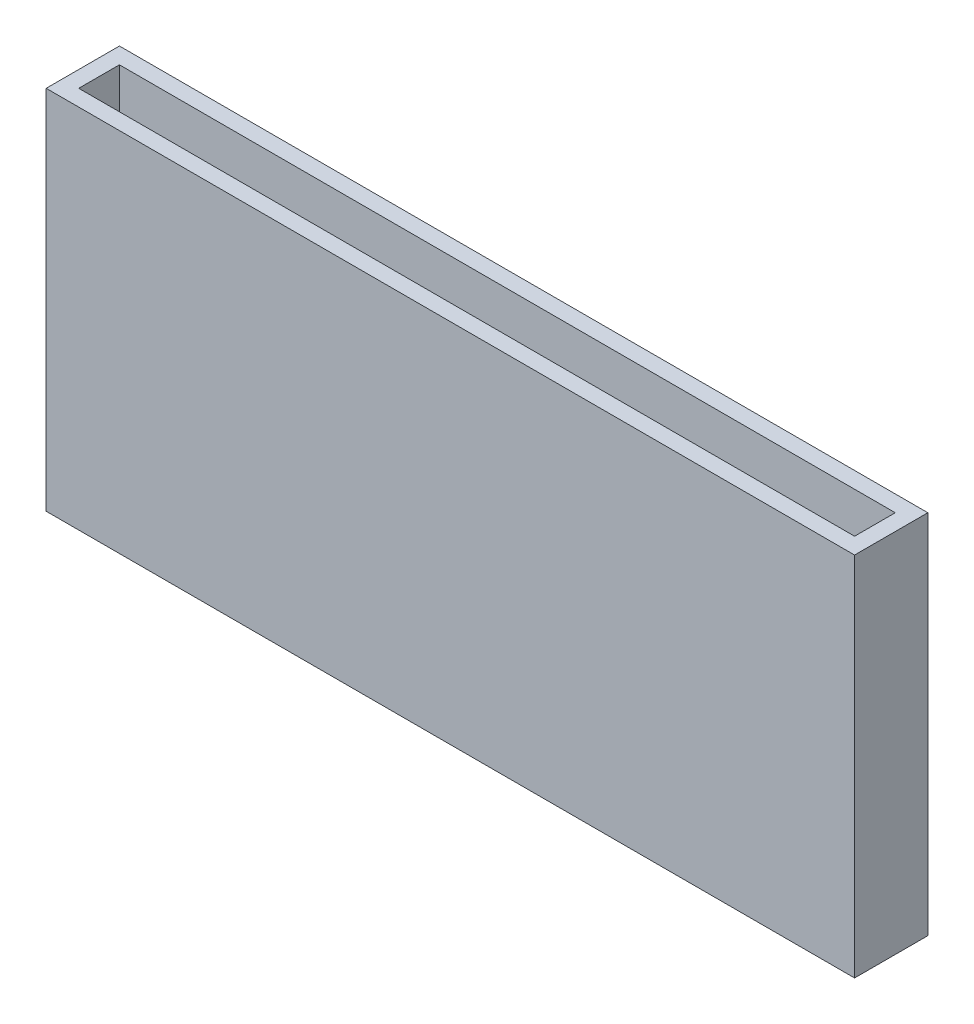
ISO-10303-21;
HEADER;
FILE_DESCRIPTION(('STEP AP214'),'2;1');
FILE_NAME('part.step','',(''),(''),'','','');
FILE_SCHEMA(('AUTOMOTIVE_DESIGN { 1 0 10303 214 1 1 1 1 }'));
ENDSEC;
DATA;
#1=APPLICATION_CONTEXT('core data for automotive mechanical design processes');
#2=APPLICATION_PROTOCOL_DEFINITION('international standard','automotive_design',2000,#1);
#3=PRODUCT_CONTEXT('',#1,'mechanical');
#4=PRODUCT('Part','Part','',(#3));
#5=PRODUCT_RELATED_PRODUCT_CATEGORY('part','',(#4));
#6=PRODUCT_DEFINITION_FORMATION('','',#4);
#7=PRODUCT_DEFINITION_CONTEXT('part definition',#1,'design');
#8=PRODUCT_DEFINITION('design','',#6,#7);
#9=PRODUCT_DEFINITION_SHAPE('','',#8);
#10=(LENGTH_UNIT() NAMED_UNIT(*) SI_UNIT(.MILLI.,.METRE.));
#11=(NAMED_UNIT(*) PLANE_ANGLE_UNIT() SI_UNIT($,.RADIAN.));
#12=(NAMED_UNIT(*) SI_UNIT($,.STERADIAN.) SOLID_ANGLE_UNIT());
#13=UNCERTAINTY_MEASURE_WITH_UNIT(LENGTH_MEASURE(1.E-05),#10,'distance_accuracy_value','');
#14=(GEOMETRIC_REPRESENTATION_CONTEXT(3) GLOBAL_UNCERTAINTY_ASSIGNED_CONTEXT((#13)) GLOBAL_UNIT_ASSIGNED_CONTEXT((#10,
#11,#12)) REPRESENTATION_CONTEXT('',''));
#15=CARTESIAN_POINT('',(0.,0.,0.));
#16=DIRECTION('',(0.,0.,1.));
#17=DIRECTION('',(1.,0.,0.));
#18=AXIS2_PLACEMENT_3D('',#15,#16,#17);
#19=CARTESIAN_POINT('',(0.,0.,4.));
#20=DIRECTION('',(0.,0.,1.));
#21=DIRECTION('',(1.,0.,0.));
#22=AXIS2_PLACEMENT_3D('',#19,#20,#21);
#23=PLANE('',#22);
#24=DIRECTION('',(1.,0.,0.));
#25=VECTOR('',#24,1.);
#26=CARTESIAN_POINT('',(0.,0.,4.));
#27=LINE('',#26,#25);
#28=CARTESIAN_POINT('',(4.,0.,4.));
#29=VERTEX_POINT('',#28);
#30=CARTESIAN_POINT('',(194.621366482887,0.,4.));
#31=VERTEX_POINT('',#30);
#32=EDGE_CURVE('E61',#29,#31,#27,.T.);
#33=ORIENTED_EDGE('',*,*,#32,.T.);
#34=DIRECTION('',(0.,-1.,0.));
#35=VECTOR('',#34,1.);
#36=CARTESIAN_POINT('',(194.621366482887,90.,4.));
#37=LINE('',#36,#35);
#38=CARTESIAN_POINT('',(194.621366482887,90.,4.));
#39=VERTEX_POINT('',#38);
#40=EDGE_CURVE('E56',#39,#31,#37,.T.);
#41=ORIENTED_EDGE('',*,*,#40,.F.);
#42=DIRECTION('',(-1.,0.,0.));
#43=VECTOR('',#42,1.);
#44=CARTESIAN_POINT('',(0.,90.,4.));
#45=LINE('',#44,#43);
#46=CARTESIAN_POINT('',(4.,90.,4.));
#47=VERTEX_POINT('',#46);
#48=EDGE_CURVE('E157',#39,#47,#45,.T.);
#49=ORIENTED_EDGE('',*,*,#48,.T.);
#50=DIRECTION('',(0.,1.,0.));
#51=VECTOR('',#50,1.);
#52=CARTESIAN_POINT('',(4.,0.,4.));
#53=LINE('',#52,#51);
#54=EDGE_CURVE('E142',#29,#47,#53,.T.);
#55=ORIENTED_EDGE('',*,*,#54,.F.);
#56=EDGE_LOOP('',(#33,#41,#49,#55));
#57=FACE_BOUND('',#56,.T.);
#58=ADVANCED_FACE('F41',(#57),#23,.T.);
#59=CARTESIAN_POINT('',(0.,90.,4.));
#60=DIRECTION('',(1.,0.,0.));
#61=DIRECTION('',(0.,0.,-1.));
#62=AXIS2_PLACEMENT_3D('',#59,#60,#61);
#63=PLANE('',#62);
#64=DIRECTION('',(0.,-1.,0.));
#65=VECTOR('',#64,1.);
#66=CARTESIAN_POINT('',(0.,90.,0.));
#67=LINE('',#66,#65);
#68=CARTESIAN_POINT('',(0.,90.,0.));
#69=VERTEX_POINT('',#68);
#70=CARTESIAN_POINT('',(0.,0.,0.));
#71=VERTEX_POINT('',#70);
#72=EDGE_CURVE('E109',#69,#71,#67,.T.);
#73=ORIENTED_EDGE('',*,*,#72,.T.);
#74=DIRECTION('',(0.,0.,-1.));
#75=VECTOR('',#74,1.);
#76=CARTESIAN_POINT('',(0.,0.,4.));
#77=LINE('',#76,#75);
#78=CARTESIAN_POINT('',(0.,0.,18.));
#79=VERTEX_POINT('',#78);
#80=EDGE_CURVE('E11',#79,#71,#77,.T.);
#81=ORIENTED_EDGE('',*,*,#80,.F.);
#82=DIRECTION('',(0.,-1.,0.));
#83=VECTOR('',#82,1.);
#84=CARTESIAN_POINT('',(0.,90.,18.));
#85=LINE('',#84,#83);
#86=CARTESIAN_POINT('',(0.,90.,18.));
#87=VERTEX_POINT('',#86);
#88=EDGE_CURVE('E107',#87,#79,#85,.T.);
#89=ORIENTED_EDGE('',*,*,#88,.F.);
#90=DIRECTION('',(0.,0.,-1.));
#91=VECTOR('',#90,1.);
#92=CARTESIAN_POINT('',(0.,90.,4.));
#93=LINE('',#92,#91);
#94=EDGE_CURVE('E160',#87,#69,#93,.T.);
#95=ORIENTED_EDGE('',*,*,#94,.T.);
#96=EDGE_LOOP('',(#73,#81,#89,#95));
#97=FACE_BOUND('',#96,.T.);
#98=ADVANCED_FACE('F43',(#97),#63,.F.);
#99=CARTESIAN_POINT('',(0.,0.,4.));
#100=DIRECTION('',(0.,1.,0.));
#101=DIRECTION('',(0.,0.,1.));
#102=AXIS2_PLACEMENT_3D('',#99,#100,#101);
#103=PLANE('',#102);
#104=DIRECTION('',(0.,0.,-1.));
#105=VECTOR('',#104,1.);
#106=CARTESIAN_POINT('',(4.,0.,14.));
#107=LINE('',#106,#105);
#108=CARTESIAN_POINT('',(4.,0.,14.));
#109=VERTEX_POINT('',#108);
#110=EDGE_CURVE('E153',#109,#29,#107,.T.);
#111=ORIENTED_EDGE('',*,*,#110,.F.);
#112=DIRECTION('',(1.,0.,0.));
#113=VECTOR('',#112,1.);
#114=CARTESIAN_POINT('',(0.,0.,14.));
#115=LINE('',#114,#113);
#116=CARTESIAN_POINT('',(194.621366482887,0.,14.));
#117=VERTEX_POINT('',#116);
#118=EDGE_CURVE('E127',#109,#117,#115,.T.);
#119=ORIENTED_EDGE('',*,*,#118,.T.);
#120=DIRECTION('',(0.,0.,-1.));
#121=VECTOR('',#120,1.);
#122=CARTESIAN_POINT('',(194.621366482887,0.,14.));
#123=LINE('',#122,#121);
#124=EDGE_CURVE('E137',#117,#31,#123,.T.);
#125=ORIENTED_EDGE('',*,*,#124,.T.);
#126=ORIENTED_EDGE('',*,*,#32,.F.);
#127=EDGE_LOOP('',(#111,#119,#125,#126));
#128=FACE_BOUND('',#127,.T.);
#129=DIRECTION('',(1.,0.,0.));
#130=VECTOR('',#129,1.);
#131=CARTESIAN_POINT('',(0.,0.,0.));
#132=LINE('',#131,#130);
#133=CARTESIAN_POINT('',(198.621366482887,0.,0.));
#134=VERTEX_POINT('',#133);
#135=EDGE_CURVE('E162',#71,#134,#132,.T.);
#136=ORIENTED_EDGE('',*,*,#135,.T.);
#137=DIRECTION('',(0.,0.,-1.));
#138=VECTOR('',#137,1.);
#139=CARTESIAN_POINT('',(198.621366482887,0.,4.));
#140=LINE('',#139,#138);
#141=CARTESIAN_POINT('',(198.621366482887,0.,18.));
#142=VERTEX_POINT('',#141);
#143=EDGE_CURVE('E49',#142,#134,#140,.T.);
#144=ORIENTED_EDGE('',*,*,#143,.F.);
#145=DIRECTION('',(1.,0.,0.));
#146=VECTOR('',#145,1.);
#147=CARTESIAN_POINT('',(0.,0.,18.));
#148=LINE('',#147,#146);
#149=EDGE_CURVE('E112',#79,#142,#148,.T.);
#150=ORIENTED_EDGE('',*,*,#149,.F.);
#151=ORIENTED_EDGE('',*,*,#80,.T.);
#152=EDGE_LOOP('',(#136,#144,#150,#151));
#153=FACE_BOUND('',#152,.T.);
#154=ADVANCED_FACE('F113',(#128,#153),#103,.F.);
#155=CARTESIAN_POINT('',(198.621366482887,90.,4.));
#156=DIRECTION('',(-1.,0.,0.));
#157=DIRECTION('',(0.,0.,1.));
#158=AXIS2_PLACEMENT_3D('',#155,#156,#157);
#159=PLANE('',#158);
#160=DIRECTION('',(0.,1.,0.));
#161=VECTOR('',#160,1.);
#162=CARTESIAN_POINT('',(198.621366482887,90.,0.));
#163=LINE('',#162,#161);
#164=CARTESIAN_POINT('',(198.621366482887,90.,0.));
#165=VERTEX_POINT('',#164);
#166=EDGE_CURVE('E164',#134,#165,#163,.T.);
#167=ORIENTED_EDGE('',*,*,#166,.T.);
#168=DIRECTION('',(0.,0.,-1.));
#169=VECTOR('',#168,1.);
#170=CARTESIAN_POINT('',(198.621366482887,90.,4.));
#171=LINE('',#170,#169);
#172=CARTESIAN_POINT('',(198.621366482887,90.,18.));
#173=VERTEX_POINT('',#172);
#174=EDGE_CURVE('E168',#173,#165,#171,.T.);
#175=ORIENTED_EDGE('',*,*,#174,.F.);
#176=DIRECTION('',(0.,1.,0.));
#177=VECTOR('',#176,1.);
#178=CARTESIAN_POINT('',(198.621366482887,90.,18.));
#179=LINE('',#178,#177);
#180=EDGE_CURVE('E118',#142,#173,#179,.T.);
#181=ORIENTED_EDGE('',*,*,#180,.F.);
#182=ORIENTED_EDGE('',*,*,#143,.T.);
#183=EDGE_LOOP('',(#167,#175,#181,#182));
#184=FACE_BOUND('',#183,.T.);
#185=ADVANCED_FACE('F172',(#184),#159,.F.);
#186=CARTESIAN_POINT('',(0.,90.,4.));
#187=DIRECTION('',(0.,-1.,0.));
#188=DIRECTION('',(0.,0.,-1.));
#189=AXIS2_PLACEMENT_3D('',#186,#187,#188);
#190=PLANE('',#189);
#191=ORIENTED_EDGE('',*,*,#94,.F.);
#192=DIRECTION('',(-1.,0.,0.));
#193=VECTOR('',#192,1.);
#194=CARTESIAN_POINT('',(0.,90.,18.));
#195=LINE('',#194,#193);
#196=EDGE_CURVE('E123',#173,#87,#195,.T.);
#197=ORIENTED_EDGE('',*,*,#196,.F.);
#198=ORIENTED_EDGE('',*,*,#174,.T.);
#199=DIRECTION('',(-1.,0.,0.));
#200=VECTOR('',#199,1.);
#201=CARTESIAN_POINT('',(0.,90.,0.));
#202=LINE('',#201,#200);
#203=EDGE_CURVE('E158',#165,#69,#202,.T.);
#204=ORIENTED_EDGE('',*,*,#203,.T.);
#205=EDGE_LOOP('',(#191,#197,#198,#204));
#206=FACE_BOUND('',#205,.T.);
#207=DIRECTION('',(-1.,0.,0.));
#208=VECTOR('',#207,1.);
#209=CARTESIAN_POINT('',(0.,90.,14.));
#210=LINE('',#209,#208);
#211=CARTESIAN_POINT('',(194.621366482887,90.,14.));
#212=VERTEX_POINT('',#211);
#213=CARTESIAN_POINT('',(4.,90.,14.));
#214=VERTEX_POINT('',#213);
#215=EDGE_CURVE('E124',#212,#214,#210,.T.);
#216=ORIENTED_EDGE('',*,*,#215,.T.);
#217=DIRECTION('',(0.,0.,-1.));
#218=VECTOR('',#217,1.);
#219=CARTESIAN_POINT('',(4.,90.,14.));
#220=LINE('',#219,#218);
#221=EDGE_CURVE('E148',#214,#47,#220,.T.);
#222=ORIENTED_EDGE('',*,*,#221,.T.);
#223=ORIENTED_EDGE('',*,*,#48,.F.);
#224=DIRECTION('',(0.,0.,-1.));
#225=VECTOR('',#224,1.);
#226=CARTESIAN_POINT('',(194.621366482887,90.,14.));
#227=LINE('',#226,#225);
#228=EDGE_CURVE('E132',#212,#39,#227,.T.);
#229=ORIENTED_EDGE('',*,*,#228,.F.);
#230=EDGE_LOOP('',(#216,#222,#223,#229));
#231=FACE_BOUND('',#230,.T.);
#232=ADVANCED_FACE('F177',(#206,#231),#190,.F.);
#233=CARTESIAN_POINT('',(0.,0.,0.));
#234=DIRECTION('',(0.,0.,1.));
#235=DIRECTION('',(1.,0.,0.));
#236=AXIS2_PLACEMENT_3D('',#233,#234,#235);
#237=PLANE('',#236);
#238=ORIENTED_EDGE('',*,*,#72,.F.);
#239=ORIENTED_EDGE('',*,*,#203,.F.);
#240=ORIENTED_EDGE('',*,*,#166,.F.);
#241=ORIENTED_EDGE('',*,*,#135,.F.);
#242=EDGE_LOOP('',(#238,#239,#240,#241));
#243=FACE_BOUND('',#242,.T.);
#244=ADVANCED_FACE('F175',(#243),#237,.F.);
#245=CARTESIAN_POINT('',(4.,0.,14.));
#246=DIRECTION('',(-1.,0.,0.));
#247=DIRECTION('',(0.,-1.,0.));
#248=AXIS2_PLACEMENT_3D('',#245,#246,#247);
#249=PLANE('',#248);
#250=ORIENTED_EDGE('',*,*,#54,.T.);
#251=ORIENTED_EDGE('',*,*,#221,.F.);
#252=DIRECTION('',(0.,1.,0.));
#253=VECTOR('',#252,1.);
#254=CARTESIAN_POINT('',(4.,0.,14.));
#255=LINE('',#254,#253);
#256=EDGE_CURVE('E145',#109,#214,#255,.T.);
#257=ORIENTED_EDGE('',*,*,#256,.F.);
#258=ORIENTED_EDGE('',*,*,#110,.T.);
#259=EDGE_LOOP('',(#250,#251,#257,#258));
#260=FACE_BOUND('',#259,.T.);
#261=ADVANCED_FACE('F188',(#260),#249,.F.);
#262=CARTESIAN_POINT('',(194.621366482887,90.,14.));
#263=DIRECTION('',(1.,0.,0.));
#264=DIRECTION('',(0.,0.,-1.));
#265=AXIS2_PLACEMENT_3D('',#262,#263,#264);
#266=PLANE('',#265);
#267=ORIENTED_EDGE('',*,*,#40,.T.);
#268=ORIENTED_EDGE('',*,*,#124,.F.);
#269=DIRECTION('',(0.,-1.,0.));
#270=VECTOR('',#269,1.);
#271=CARTESIAN_POINT('',(194.621366482887,90.,14.));
#272=LINE('',#271,#270);
#273=EDGE_CURVE('E140',#212,#117,#272,.T.);
#274=ORIENTED_EDGE('',*,*,#273,.F.);
#275=ORIENTED_EDGE('',*,*,#228,.T.);
#276=EDGE_LOOP('',(#267,#268,#274,#275));
#277=FACE_BOUND('',#276,.T.);
#278=ADVANCED_FACE('F191',(#277),#266,.F.);
#279=CARTESIAN_POINT('',(0.,0.,14.));
#280=DIRECTION('',(0.,0.,1.));
#281=DIRECTION('',(1.,0.,0.));
#282=AXIS2_PLACEMENT_3D('',#279,#280,#281);
#283=PLANE('',#282);
#284=ORIENTED_EDGE('',*,*,#118,.F.);
#285=ORIENTED_EDGE('',*,*,#256,.T.);
#286=ORIENTED_EDGE('',*,*,#215,.F.);
#287=ORIENTED_EDGE('',*,*,#273,.T.);
#288=EDGE_LOOP('',(#284,#285,#286,#287));
#289=FACE_BOUND('',#288,.T.);
#290=ADVANCED_FACE('F185',(#289),#283,.F.);
#291=CARTESIAN_POINT('',(0.,0.,18.));
#292=DIRECTION('',(0.,0.,1.));
#293=DIRECTION('',(1.,0.,0.));
#294=AXIS2_PLACEMENT_3D('',#291,#292,#293);
#295=PLANE('',#294);
#296=ORIENTED_EDGE('',*,*,#88,.T.);
#297=ORIENTED_EDGE('',*,*,#149,.T.);
#298=ORIENTED_EDGE('',*,*,#180,.T.);
#299=ORIENTED_EDGE('',*,*,#196,.T.);
#300=EDGE_LOOP('',(#296,#297,#298,#299));
#301=FACE_BOUND('',#300,.T.);
#302=ADVANCED_FACE('F121',(#301),#295,.T.);
#303=CLOSED_SHELL('',(#58,#98,#154,#185,#232,#244,#261,#278,#290,#302));
#304=MANIFOLD_SOLID_BREP('B2',#303);
#305=ADVANCED_BREP_SHAPE_REPRESENTATION('',(#18,#304),#14);
#306=SHAPE_DEFINITION_REPRESENTATION(#9,#305);
ENDSEC;
END-ISO-10303-21;
